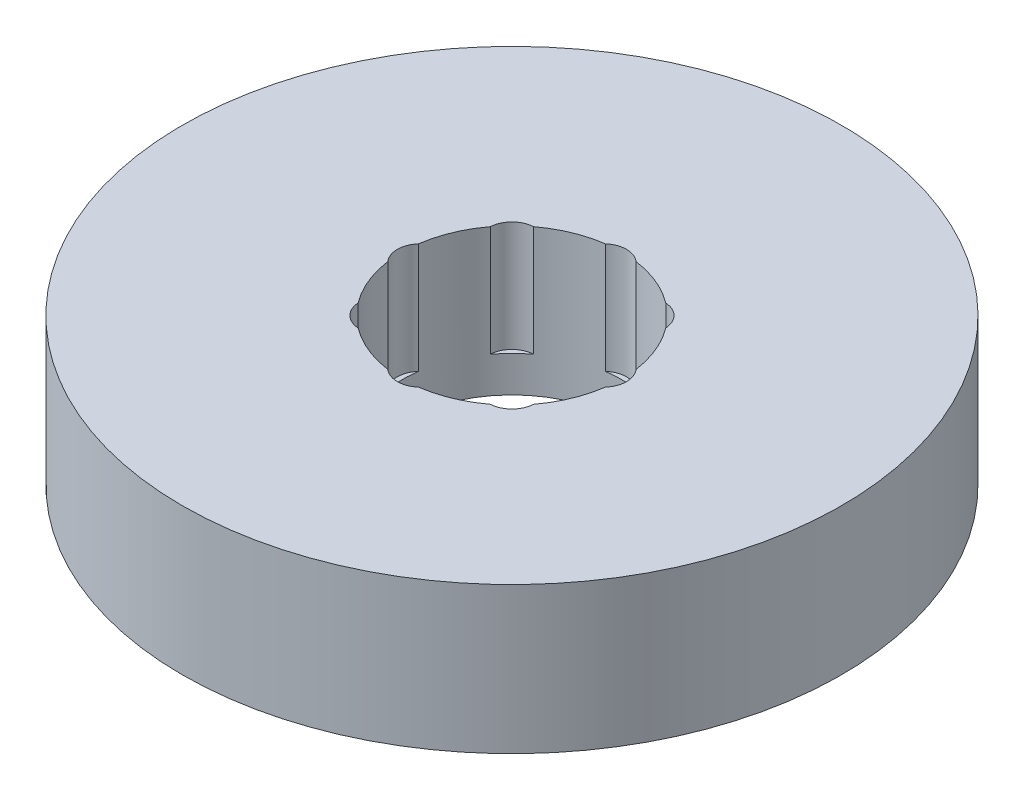
ISO-10303-21;
HEADER;
FILE_DESCRIPTION(('STEP AP214'),'2;1');
FILE_NAME('part.step','',(''),(''),'','','');
FILE_SCHEMA(('AUTOMOTIVE_DESIGN { 1 0 10303 214 1 1 1 1 }'));
ENDSEC;
DATA;
#1=APPLICATION_CONTEXT('core data for automotive mechanical design processes');
#2=APPLICATION_PROTOCOL_DEFINITION('international standard','automotive_design',2000,#1);
#3=PRODUCT_CONTEXT('',#1,'mechanical');
#4=PRODUCT('Part','Part','',(#3));
#5=PRODUCT_RELATED_PRODUCT_CATEGORY('part','',(#4));
#6=PRODUCT_DEFINITION_FORMATION('','',#4);
#7=PRODUCT_DEFINITION_CONTEXT('part definition',#1,'design');
#8=PRODUCT_DEFINITION('design','',#6,#7);
#9=PRODUCT_DEFINITION_SHAPE('','',#8);
#10=(LENGTH_UNIT() NAMED_UNIT(*) SI_UNIT(.MILLI.,.METRE.));
#11=(NAMED_UNIT(*) PLANE_ANGLE_UNIT() SI_UNIT($,.RADIAN.));
#12=(NAMED_UNIT(*) SI_UNIT($,.STERADIAN.) SOLID_ANGLE_UNIT());
#13=UNCERTAINTY_MEASURE_WITH_UNIT(LENGTH_MEASURE(1.E-05),#10,'distance_accuracy_value','');
#14=(GEOMETRIC_REPRESENTATION_CONTEXT(3) GLOBAL_UNCERTAINTY_ASSIGNED_CONTEXT((#13)) GLOBAL_UNIT_ASSIGNED_CONTEXT((#10,
#11,#12)) REPRESENTATION_CONTEXT('',''));
#15=CARTESIAN_POINT('',(0.,0.,0.));
#16=DIRECTION('',(0.,0.,1.));
#17=DIRECTION('',(1.,0.,0.));
#18=AXIS2_PLACEMENT_3D('',#15,#16,#17);
#19=CARTESIAN_POINT('',(0.,10.,0.));
#20=DIRECTION('',(0.,-1.,0.));
#21=DIRECTION('',(0.,0.,-1.));
#22=AXIS2_PLACEMENT_3D('',#19,#20,#21);
#23=CYLINDRICAL_SURFACE('',#22,22.5);
#24=CARTESIAN_POINT('',(0.,10.,0.));
#25=DIRECTION('',(0.,1.,0.));
#26=DIRECTION('',(0.,0.,1.));
#27=AXIS2_PLACEMENT_3D('',#24,#25,#26);
#28=CIRCLE('',#27,22.5);
#29=CARTESIAN_POINT('',(0.,10.,22.5));
#30=VERTEX_POINT('',#29);
#31=EDGE_CURVE('E183',#30,#30,#28,.T.);
#32=ORIENTED_EDGE('',*,*,#31,.F.);
#33=EDGE_LOOP('',(#32));
#34=FACE_BOUND('',#33,.T.);
#35=CARTESIAN_POINT('',(0.,0.,0.));
#36=DIRECTION('',(0.,1.,0.));
#37=DIRECTION('',(0.,0.,1.));
#38=AXIS2_PLACEMENT_3D('',#35,#36,#37);
#39=CIRCLE('',#38,22.5);
#40=CARTESIAN_POINT('',(0.,0.,22.5));
#41=VERTEX_POINT('',#40);
#42=EDGE_CURVE('E182',#41,#41,#39,.T.);
#43=ORIENTED_EDGE('',*,*,#42,.T.);
#44=EDGE_LOOP('',(#43));
#45=FACE_BOUND('',#44,.T.);
#46=ADVANCED_FACE('F39',(#34,#45),#23,.T.);
#47=CARTESIAN_POINT('',(0.,10.,0.));
#48=DIRECTION('',(0.,1.,0.));
#49=DIRECTION('',(0.,0.,1.));
#50=AXIS2_PLACEMENT_3D('',#47,#48,#49);
#51=PLANE('',#50);
#52=CARTESIAN_POINT('',(0.,10.,6.24532366336208));
#53=DIRECTION('',(0.,1.,0.));
#54=DIRECTION('',(1.,0.,0.));
#55=AXIS2_PLACEMENT_3D('',#52,#53,#54);
#56=CIRCLE('',#55,1.57803678648881);
#57=CARTESIAN_POINT('',(-1.04624569476172,10.,7.42666613940552));
#58=VERTEX_POINT('',#57);
#59=CARTESIAN_POINT('',(1.04624569476177,10.,7.42666613940552));
#60=VERTEX_POINT('',#59);
#61=EDGE_CURVE('E256',#58,#60,#56,.T.);
#62=ORIENTED_EDGE('',*,*,#61,.F.);
#63=CARTESIAN_POINT('',(0.,10.,0.));
#64=DIRECTION('',(0.,1.,0.));
#65=DIRECTION('',(0.,0.,1.));
#66=AXIS2_PLACEMENT_3D('',#63,#64,#65);
#67=CIRCLE('',#66,7.5);
#68=CARTESIAN_POINT('',(-4.51163856322889,10.,5.99125341433543));
#69=VERTEX_POINT('',#68);
#70=EDGE_CURVE('E175',#69,#58,#67,.T.);
#71=ORIENTED_EDGE('',*,*,#70,.F.);
#72=CARTESIAN_POINT('',(-4.41611071306813,10.,4.41611071306815));
#73=DIRECTION('',(0.,1.,0.));
#74=DIRECTION('',(0.707106781186549,0.,0.707106781186546));
#75=AXIS2_PLACEMENT_3D('',#72,#73,#74);
#76=CIRCLE('',#75,1.57803678648881);
#77=CARTESIAN_POINT('',(-5.99125341433541,10.,4.51163856322891));
#78=VERTEX_POINT('',#77);
#79=EDGE_CURVE('E152',#78,#69,#76,.T.);
#80=ORIENTED_EDGE('',*,*,#79,.F.);
#81=CARTESIAN_POINT('',(-7.42666613940552,10.,1.04624569476175));
#82=VERTEX_POINT('',#81);
#83=EDGE_CURVE('E168',#82,#78,#67,.T.);
#84=ORIENTED_EDGE('',*,*,#83,.F.);
#85=CARTESIAN_POINT('',(-6.24532366336208,10.,0.));
#86=DIRECTION('',(0.,1.,0.));
#87=DIRECTION('',(0.,0.,1.));
#88=AXIS2_PLACEMENT_3D('',#85,#86,#87);
#89=CIRCLE('',#88,1.57803678648881);
#90=CARTESIAN_POINT('',(-7.42666613940552,10.,-1.04624569476175));
#91=VERTEX_POINT('',#90);
#92=EDGE_CURVE('E205',#91,#82,#89,.T.);
#93=ORIENTED_EDGE('',*,*,#92,.F.);
#94=CARTESIAN_POINT('',(-5.99125341433548,10.,-4.51163856322883));
#95=VERTEX_POINT('',#94);
#96=EDGE_CURVE('E181',#95,#91,#67,.T.);
#97=ORIENTED_EDGE('',*,*,#96,.F.);
#98=CARTESIAN_POINT('',(-4.41611071306819,10.,-4.41611071306809));
#99=DIRECTION('',(0.,1.,0.));
#100=DIRECTION('',(-0.707106781186539,0.,0.707106781186556));
#101=AXIS2_PLACEMENT_3D('',#98,#99,#100);
#102=CIRCLE('',#101,1.57803678648881);
#103=CARTESIAN_POINT('',(-4.51163856322897,10.,-5.99125341433537));
#104=VERTEX_POINT('',#103);
#105=EDGE_CURVE('E453',#104,#95,#102,.T.);
#106=ORIENTED_EDGE('',*,*,#105,.F.);
#107=CARTESIAN_POINT('',(-1.04624569476182,10.,-7.42666613940551));
#108=VERTEX_POINT('',#107);
#109=EDGE_CURVE('E189',#108,#104,#67,.T.);
#110=ORIENTED_EDGE('',*,*,#109,.F.);
#111=CARTESIAN_POINT('',(0.,10.,-6.24532366336208));
#112=DIRECTION('',(0.,1.,0.));
#113=DIRECTION('',(-1.,0.,0.));
#114=AXIS2_PLACEMENT_3D('',#111,#112,#113);
#115=CIRCLE('',#114,1.57803678648881);
#116=CARTESIAN_POINT('',(1.04624569476167,10.,-7.42666613940553));
#117=VERTEX_POINT('',#116);
#118=EDGE_CURVE('E462',#117,#108,#115,.T.);
#119=ORIENTED_EDGE('',*,*,#118,.F.);
#120=CARTESIAN_POINT('',(4.51163856322885,10.,-5.99125341433546));
#121=VERTEX_POINT('',#120);
#122=EDGE_CURVE('E197',#121,#117,#67,.T.);
#123=ORIENTED_EDGE('',*,*,#122,.F.);
#124=CARTESIAN_POINT('',(4.4161107130681,10.,-4.41611071306818));
#125=DIRECTION('',(0.,1.,0.));
#126=DIRECTION('',(-0.707106781186554,0.,-0.707106781186541));
#127=AXIS2_PLACEMENT_3D('',#124,#125,#126);
#128=CIRCLE('',#127,1.57803678648881);
#129=CARTESIAN_POINT('',(5.99125341433538,10.,-4.51163856322895));
#130=VERTEX_POINT('',#129);
#131=EDGE_CURVE('E470',#130,#121,#128,.T.);
#132=ORIENTED_EDGE('',*,*,#131,.F.);
#133=CARTESIAN_POINT('',(7.42666613940552,10.,-1.04624569476175));
#134=VERTEX_POINT('',#133);
#135=EDGE_CURVE('E489',#134,#130,#67,.T.);
#136=ORIENTED_EDGE('',*,*,#135,.F.);
#137=CARTESIAN_POINT('',(6.24532366336208,10.,0.));
#138=DIRECTION('',(0.,1.,0.));
#139=DIRECTION('',(0.,0.,-1.));
#140=AXIS2_PLACEMENT_3D('',#137,#138,#139);
#141=CIRCLE('',#140,1.57803678648881);
#142=CARTESIAN_POINT('',(7.42666613940552,10.,1.04624569476175));
#143=VERTEX_POINT('',#142);
#144=EDGE_CURVE('E476',#143,#134,#141,.T.);
#145=ORIENTED_EDGE('',*,*,#144,.F.);
#146=CARTESIAN_POINT('',(5.99125341433545,10.,4.51163856322887));
#147=VERTEX_POINT('',#146);
#148=EDGE_CURVE('E491',#147,#143,#67,.T.);
#149=ORIENTED_EDGE('',*,*,#148,.F.);
#150=CARTESIAN_POINT('',(4.41611071306816,10.,4.41611071306812));
#151=DIRECTION('',(0.,1.,0.));
#152=DIRECTION('',(0.707106781186544,0.,-0.707106781186551));
#153=AXIS2_PLACEMENT_3D('',#150,#151,#152);
#154=CIRCLE('',#153,1.57803678648881);
#155=CARTESIAN_POINT('',(4.51163856322893,10.,5.9912534143354));
#156=VERTEX_POINT('',#155);
#157=EDGE_CURVE('E475',#156,#147,#154,.T.);
#158=ORIENTED_EDGE('',*,*,#157,.F.);
#159=EDGE_CURVE('E190',#60,#156,#67,.T.);
#160=ORIENTED_EDGE('',*,*,#159,.F.);
#161=EDGE_LOOP('',(#62,#71,#80,#84,#93,#97,#106,#110,#119,#123,#132,#136,#145,#149,#158,#160));
#162=FACE_BOUND('',#161,.T.);
#163=ORIENTED_EDGE('',*,*,#31,.T.);
#164=EDGE_LOOP('',(#163));
#165=FACE_BOUND('',#164,.T.);
#166=ADVANCED_FACE('F170',(#162,#165),#51,.T.);
#167=CARTESIAN_POINT('',(0.,0.,0.));
#168=DIRECTION('',(0.,1.,0.));
#169=DIRECTION('',(0.,0.,1.));
#170=AXIS2_PLACEMENT_3D('',#167,#168,#169);
#171=PLANE('',#170);
#172=CARTESIAN_POINT('',(0.,0.,0.));
#173=DIRECTION('',(0.,1.,0.));
#174=DIRECTION('',(0.,0.,1.));
#175=AXIS2_PLACEMENT_3D('',#172,#173,#174);
#176=CIRCLE('',#175,7.5);
#177=CARTESIAN_POINT('',(0.,0.,7.5));
#178=VERTEX_POINT('',#177);
#179=EDGE_CURVE('E191',#178,#178,#176,.T.);
#180=ORIENTED_EDGE('',*,*,#179,.T.);
#181=EDGE_LOOP('',(#180));
#182=FACE_BOUND('',#181,.T.);
#183=ORIENTED_EDGE('',*,*,#42,.F.);
#184=EDGE_LOOP('',(#183));
#185=FACE_BOUND('',#184,.T.);
#186=ADVANCED_FACE('F277',(#182,#185),#171,.F.);
#187=CARTESIAN_POINT('',(0.,10.,0.));
#188=DIRECTION('',(0.,-1.,0.));
#189=DIRECTION('',(0.,0.,-1.));
#190=AXIS2_PLACEMENT_3D('',#187,#188,#189);
#191=CYLINDRICAL_SURFACE('',#190,7.5);
#192=DIRECTION('',(0.,1.,0.));
#193=VECTOR('',#192,1.);
#194=CARTESIAN_POINT('',(-1.04624569476172,6.22964103238168,7.42666613940552));
#195=LINE('',#194,#193);
#196=CARTESIAN_POINT('',(-1.04624569476172,2.45928206476335,7.42666613940552));
#197=VERTEX_POINT('',#196);
#198=EDGE_CURVE('E11',#197,#58,#195,.T.);
#199=ORIENTED_EDGE('',*,*,#198,.F.);
#200=CARTESIAN_POINT('',(0.,2.45928206476335,0.));
#201=DIRECTION('',(0.,1.,0.));
#202=DIRECTION('',(0.,0.,1.));
#203=AXIS2_PLACEMENT_3D('',#200,#201,#202);
#204=CIRCLE('',#203,7.5);
#205=CARTESIAN_POINT('',(1.04624569476177,2.45928206476335,7.42666613940552));
#206=VERTEX_POINT('',#205);
#207=EDGE_CURVE('E251',#197,#206,#204,.T.);
#208=ORIENTED_EDGE('',*,*,#207,.T.);
#209=DIRECTION('',(0.,1.,0.));
#210=VECTOR('',#209,1.);
#211=CARTESIAN_POINT('',(1.04624569476177,6.22964103238168,7.42666613940551));
#212=LINE('',#211,#210);
#213=EDGE_CURVE('E46',#60,#206,#212,.F.);
#214=ORIENTED_EDGE('',*,*,#213,.F.);
#215=ORIENTED_EDGE('',*,*,#159,.T.);
#216=DIRECTION('',(0.,1.,0.));
#217=VECTOR('',#216,1.);
#218=CARTESIAN_POINT('',(4.51163856322893,6.22964103238168,5.9912534143354));
#219=LINE('',#218,#217);
#220=CARTESIAN_POINT('',(4.51163856322893,2.45928206476335,5.9912534143354));
#221=VERTEX_POINT('',#220);
#222=EDGE_CURVE('E253',#221,#156,#219,.T.);
#223=ORIENTED_EDGE('',*,*,#222,.F.);
#224=CARTESIAN_POINT('',(0.,2.45928206476335,0.));
#225=DIRECTION('',(0.,1.,0.));
#226=DIRECTION('',(0.,0.,1.));
#227=AXIS2_PLACEMENT_3D('',#224,#225,#226);
#228=CIRCLE('',#227,7.5);
#229=CARTESIAN_POINT('',(5.99125341433545,2.45928206476335,4.51163856322887));
#230=VERTEX_POINT('',#229);
#231=EDGE_CURVE('E246',#221,#230,#228,.T.);
#232=ORIENTED_EDGE('',*,*,#231,.T.);
#233=DIRECTION('',(0.,1.,0.));
#234=VECTOR('',#233,1.);
#235=CARTESIAN_POINT('',(5.99125341433545,6.22964103238168,4.51163856322886));
#236=LINE('',#235,#234);
#237=EDGE_CURVE('E248',#147,#230,#236,.F.);
#238=ORIENTED_EDGE('',*,*,#237,.F.);
#239=ORIENTED_EDGE('',*,*,#148,.T.);
#240=DIRECTION('',(0.,1.,0.));
#241=VECTOR('',#240,1.);
#242=CARTESIAN_POINT('',(7.42666613940552,6.22964103238168,1.04624569476175));
#243=LINE('',#242,#241);
#244=CARTESIAN_POINT('',(7.42666613940552,2.45928206476335,1.04624569476175));
#245=VERTEX_POINT('',#244);
#246=EDGE_CURVE('E243',#245,#143,#243,.T.);
#247=ORIENTED_EDGE('',*,*,#246,.F.);
#248=CARTESIAN_POINT('',(0.,2.45928206476335,0.));
#249=DIRECTION('',(0.,1.,0.));
#250=DIRECTION('',(0.,0.,1.));
#251=AXIS2_PLACEMENT_3D('',#248,#249,#250);
#252=CIRCLE('',#251,7.5);
#253=CARTESIAN_POINT('',(7.42666613940552,2.45928206476335,-1.04624569476175));
#254=VERTEX_POINT('',#253);
#255=EDGE_CURVE('E236',#245,#254,#252,.T.);
#256=ORIENTED_EDGE('',*,*,#255,.T.);
#257=DIRECTION('',(0.,1.,0.));
#258=VECTOR('',#257,1.);
#259=CARTESIAN_POINT('',(7.42666613940552,6.22964103238168,-1.04624569476175));
#260=LINE('',#259,#258);
#261=EDGE_CURVE('E241',#134,#254,#260,.F.);
#262=ORIENTED_EDGE('',*,*,#261,.F.);
#263=ORIENTED_EDGE('',*,*,#135,.T.);
#264=DIRECTION('',(0.,1.,0.));
#265=VECTOR('',#264,1.);
#266=CARTESIAN_POINT('',(5.99125341433538,6.22964103238168,-4.51163856322895));
#267=LINE('',#266,#265);
#268=CARTESIAN_POINT('',(5.99125341433538,2.45928206476335,-4.51163856322895));
#269=VERTEX_POINT('',#268);
#270=EDGE_CURVE('E237',#269,#130,#267,.T.);
#271=ORIENTED_EDGE('',*,*,#270,.F.);
#272=CARTESIAN_POINT('',(0.,2.45928206476335,0.));
#273=DIRECTION('',(0.,1.,0.));
#274=DIRECTION('',(0.,0.,1.));
#275=AXIS2_PLACEMENT_3D('',#272,#273,#274);
#276=CIRCLE('',#275,7.5);
#277=CARTESIAN_POINT('',(4.51163856322885,2.45928206476335,-5.99125341433546));
#278=VERTEX_POINT('',#277);
#279=EDGE_CURVE('E229',#269,#278,#276,.T.);
#280=ORIENTED_EDGE('',*,*,#279,.T.);
#281=DIRECTION('',(0.,1.,0.));
#282=VECTOR('',#281,1.);
#283=CARTESIAN_POINT('',(4.51163856322884,6.22964103238168,-5.99125341433546));
#284=LINE('',#283,#282);
#285=EDGE_CURVE('E232',#121,#278,#284,.F.);
#286=ORIENTED_EDGE('',*,*,#285,.F.);
#287=ORIENTED_EDGE('',*,*,#122,.T.);
#288=DIRECTION('',(0.,1.,0.));
#289=VECTOR('',#288,1.);
#290=CARTESIAN_POINT('',(1.04624569476167,6.22964103238168,-7.42666613940553));
#291=LINE('',#290,#289);
#292=CARTESIAN_POINT('',(1.04624569476167,2.45928206476335,-7.42666613940553));
#293=VERTEX_POINT('',#292);
#294=EDGE_CURVE('E227',#293,#117,#291,.T.);
#295=ORIENTED_EDGE('',*,*,#294,.F.);
#296=CARTESIAN_POINT('',(0.,2.45928206476335,0.));
#297=DIRECTION('',(0.,1.,0.));
#298=DIRECTION('',(0.,0.,1.));
#299=AXIS2_PLACEMENT_3D('',#296,#297,#298);
#300=CIRCLE('',#299,7.5);
#301=CARTESIAN_POINT('',(-1.04624569476182,2.45928206476335,-7.42666613940551));
#302=VERTEX_POINT('',#301);
#303=EDGE_CURVE('E225',#293,#302,#300,.T.);
#304=ORIENTED_EDGE('',*,*,#303,.T.);
#305=DIRECTION('',(0.,1.,0.));
#306=VECTOR('',#305,1.);
#307=CARTESIAN_POINT('',(-1.04624569476183,6.22964103238168,-7.42666613940551));
#308=LINE('',#307,#306);
#309=EDGE_CURVE('E223',#108,#302,#308,.F.);
#310=ORIENTED_EDGE('',*,*,#309,.F.);
#311=ORIENTED_EDGE('',*,*,#109,.T.);
#312=DIRECTION('',(0.,1.,0.));
#313=VECTOR('',#312,1.);
#314=CARTESIAN_POINT('',(-4.51163856322897,6.22964103238168,-5.99125341433537));
#315=LINE('',#314,#313);
#316=CARTESIAN_POINT('',(-4.51163856322897,2.45928206476335,-5.99125341433537));
#317=VERTEX_POINT('',#316);
#318=EDGE_CURVE('E219',#317,#104,#315,.T.);
#319=ORIENTED_EDGE('',*,*,#318,.F.);
#320=CARTESIAN_POINT('',(0.,2.45928206476335,0.));
#321=DIRECTION('',(0.,1.,0.));
#322=DIRECTION('',(0.,0.,1.));
#323=AXIS2_PLACEMENT_3D('',#320,#321,#322);
#324=CIRCLE('',#323,7.5);
#325=CARTESIAN_POINT('',(-5.99125341433548,2.45928206476335,-4.51163856322883));
#326=VERTEX_POINT('',#325);
#327=EDGE_CURVE('E159',#317,#326,#324,.T.);
#328=ORIENTED_EDGE('',*,*,#327,.T.);
#329=DIRECTION('',(0.,1.,0.));
#330=VECTOR('',#329,1.);
#331=CARTESIAN_POINT('',(-5.99125341433548,6.22964103238168,-4.51163856322882));
#332=LINE('',#331,#330);
#333=EDGE_CURVE('E220',#95,#326,#332,.F.);
#334=ORIENTED_EDGE('',*,*,#333,.F.);
#335=ORIENTED_EDGE('',*,*,#96,.T.);
#336=DIRECTION('',(0.,1.,0.));
#337=VECTOR('',#336,1.);
#338=CARTESIAN_POINT('',(-7.42666613940552,6.22964103238168,-1.04624569476175));
#339=LINE('',#338,#337);
#340=CARTESIAN_POINT('',(-7.42666613940552,2.45928206476335,-1.04624569476175));
#341=VERTEX_POINT('',#340);
#342=EDGE_CURVE('E209',#341,#91,#339,.T.);
#343=ORIENTED_EDGE('',*,*,#342,.F.);
#344=CARTESIAN_POINT('',(0.,2.45928206476335,0.));
#345=DIRECTION('',(0.,1.,0.));
#346=DIRECTION('',(0.,0.,1.));
#347=AXIS2_PLACEMENT_3D('',#344,#345,#346);
#348=CIRCLE('',#347,7.5);
#349=CARTESIAN_POINT('',(-7.42666613940552,2.45928206476335,1.04624569476175));
#350=VERTEX_POINT('',#349);
#351=EDGE_CURVE('E206',#341,#350,#348,.T.);
#352=ORIENTED_EDGE('',*,*,#351,.T.);
#353=DIRECTION('',(0.,1.,0.));
#354=VECTOR('',#353,1.);
#355=CARTESIAN_POINT('',(-7.42666613940552,6.22964103238168,1.04624569476175));
#356=LINE('',#355,#354);
#357=EDGE_CURVE('E179',#82,#350,#356,.F.);
#358=ORIENTED_EDGE('',*,*,#357,.F.);
#359=ORIENTED_EDGE('',*,*,#83,.T.);
#360=DIRECTION('',(0.,1.,0.));
#361=VECTOR('',#360,1.);
#362=CARTESIAN_POINT('',(-5.99125341433542,6.22964103238168,4.51163856322891));
#363=LINE('',#362,#361);
#364=CARTESIAN_POINT('',(-5.99125341433541,2.45928206476335,4.51163856322891));
#365=VERTEX_POINT('',#364);
#366=EDGE_CURVE('E147',#365,#78,#363,.T.);
#367=ORIENTED_EDGE('',*,*,#366,.F.);
#368=CARTESIAN_POINT('',(0.,2.45928206476335,0.));
#369=DIRECTION('',(0.,1.,0.));
#370=DIRECTION('',(0.,0.,1.));
#371=AXIS2_PLACEMENT_3D('',#368,#369,#370);
#372=CIRCLE('',#371,7.5);
#373=CARTESIAN_POINT('',(-4.51163856322889,2.45928206476335,5.99125341433543));
#374=VERTEX_POINT('',#373);
#375=EDGE_CURVE('E215',#365,#374,#372,.T.);
#376=ORIENTED_EDGE('',*,*,#375,.T.);
#377=DIRECTION('',(0.,1.,0.));
#378=VECTOR('',#377,1.);
#379=CARTESIAN_POINT('',(-4.51163856322889,6.22964103238168,5.99125341433543));
#380=LINE('',#379,#378);
#381=EDGE_CURVE('E161',#69,#374,#380,.F.);
#382=ORIENTED_EDGE('',*,*,#381,.F.);
#383=ORIENTED_EDGE('',*,*,#70,.T.);
#384=EDGE_LOOP('',(#199,#208,#214,#215,#223,#232,#238,#239,#247,#256,#262,#263,#271,#280,#286,
#287,#295,#304,#310,#311,#319,#328,#334,#335,#343,#352,#358,#359,#367,#376,#382,#383));
#385=FACE_BOUND('',#384,.T.);
#386=ORIENTED_EDGE('',*,*,#179,.F.);
#387=EDGE_LOOP('',(#386));
#388=FACE_BOUND('',#387,.T.);
#389=ADVANCED_FACE('F176',(#385,#388),#191,.F.);
#390=CARTESIAN_POINT('',(-6.24532366336208,2.45928206476335,0.));
#391=DIRECTION('',(0.,1.,0.));
#392=DIRECTION('',(0.,0.,1.));
#393=AXIS2_PLACEMENT_3D('',#390,#391,#392);
#394=CYLINDRICAL_SURFACE('',#393,1.57803678648881);
#395=ORIENTED_EDGE('',*,*,#342,.T.);
#396=ORIENTED_EDGE('',*,*,#92,.T.);
#397=ORIENTED_EDGE('',*,*,#357,.T.);
#398=CARTESIAN_POINT('',(-6.24532366336208,2.45928206476335,0.));
#399=DIRECTION('',(0.,1.,0.));
#400=DIRECTION('',(0.,0.,1.));
#401=AXIS2_PLACEMENT_3D('',#398,#399,#400);
#402=CIRCLE('',#401,1.57803678648881);
#403=EDGE_CURVE('E200',#341,#350,#402,.T.);
#404=ORIENTED_EDGE('',*,*,#403,.F.);
#405=EDGE_LOOP('',(#395,#396,#397,#404));
#406=FACE_BOUND('',#405,.T.);
#407=ADVANCED_FACE('F286',(#406),#394,.F.);
#408=CARTESIAN_POINT('',(-6.24532366336208,2.45928206476335,0.));
#409=DIRECTION('',(0.,1.,0.));
#410=DIRECTION('',(0.,0.,1.));
#411=AXIS2_PLACEMENT_3D('',#408,#409,#410);
#412=PLANE('',#411);
#413=ORIENTED_EDGE('',*,*,#403,.T.);
#414=ORIENTED_EDGE('',*,*,#351,.F.);
#415=EDGE_LOOP('',(#413,#414));
#416=FACE_BOUND('',#415,.T.);
#417=ADVANCED_FACE('F289',(#416),#412,.T.);
#418=CARTESIAN_POINT('',(-4.41611071306813,2.45928206476335,4.41611071306815));
#419=DIRECTION('',(0.,1.,0.));
#420=DIRECTION('',(0.,0.,1.));
#421=AXIS2_PLACEMENT_3D('',#418,#419,#420);
#422=CYLINDRICAL_SURFACE('',#421,1.57803678648881);
#423=ORIENTED_EDGE('',*,*,#366,.T.);
#424=ORIENTED_EDGE('',*,*,#79,.T.);
#425=ORIENTED_EDGE('',*,*,#381,.T.);
#426=CARTESIAN_POINT('',(-4.41611071306813,2.45928206476335,4.41611071306815));
#427=DIRECTION('',(0.,1.,0.));
#428=DIRECTION('',(0.707106781186549,0.,0.707106781186546));
#429=AXIS2_PLACEMENT_3D('',#426,#427,#428);
#430=CIRCLE('',#429,1.57803678648881);
#431=EDGE_CURVE('E156',#365,#374,#430,.T.);
#432=ORIENTED_EDGE('',*,*,#431,.F.);
#433=EDGE_LOOP('',(#423,#424,#425,#432));
#434=FACE_BOUND('',#433,.T.);
#435=ADVANCED_FACE('F155',(#434),#422,.F.);
#436=CARTESIAN_POINT('',(-4.41611071306813,2.45928206476335,4.41611071306815));
#437=DIRECTION('',(0.,1.,0.));
#438=DIRECTION('',(0.707106781186549,0.,0.707106781186546));
#439=AXIS2_PLACEMENT_3D('',#436,#437,#438);
#440=PLANE('',#439);
#441=ORIENTED_EDGE('',*,*,#431,.T.);
#442=ORIENTED_EDGE('',*,*,#375,.F.);
#443=EDGE_LOOP('',(#441,#442));
#444=FACE_BOUND('',#443,.T.);
#445=ADVANCED_FACE('F300',(#444),#440,.T.);
#446=CARTESIAN_POINT('',(-4.41611071306819,2.45928206476335,-4.41611071306809));
#447=DIRECTION('',(0.,1.,0.));
#448=DIRECTION('',(0.,0.,1.));
#449=AXIS2_PLACEMENT_3D('',#446,#447,#448);
#450=CYLINDRICAL_SURFACE('',#449,1.57803678648881);
#451=ORIENTED_EDGE('',*,*,#318,.T.);
#452=ORIENTED_EDGE('',*,*,#105,.T.);
#453=ORIENTED_EDGE('',*,*,#333,.T.);
#454=CARTESIAN_POINT('',(-4.41611071306819,2.45928206476335,-4.41611071306809));
#455=DIRECTION('',(0.,1.,0.));
#456=DIRECTION('',(-0.707106781186539,0.,0.707106781186556));
#457=AXIS2_PLACEMENT_3D('',#454,#455,#456);
#458=CIRCLE('',#457,1.57803678648881);
#459=EDGE_CURVE('E454',#317,#326,#458,.T.);
#460=ORIENTED_EDGE('',*,*,#459,.F.);
#461=EDGE_LOOP('',(#451,#452,#453,#460));
#462=FACE_BOUND('',#461,.T.);
#463=ADVANCED_FACE('F299',(#462),#450,.F.);
#464=CARTESIAN_POINT('',(-4.41611071306819,2.45928206476335,-4.41611071306809));
#465=DIRECTION('',(0.,1.,0.));
#466=DIRECTION('',(-0.707106781186539,0.,0.707106781186556));
#467=AXIS2_PLACEMENT_3D('',#464,#465,#466);
#468=PLANE('',#467);
#469=ORIENTED_EDGE('',*,*,#459,.T.);
#470=ORIENTED_EDGE('',*,*,#327,.F.);
#471=EDGE_LOOP('',(#469,#470));
#472=FACE_BOUND('',#471,.T.);
#473=ADVANCED_FACE('F379',(#472),#468,.T.);
#474=CARTESIAN_POINT('',(0.,2.45928206476335,-6.24532366336208));
#475=DIRECTION('',(0.,1.,0.));
#476=DIRECTION('',(0.,0.,1.));
#477=AXIS2_PLACEMENT_3D('',#474,#475,#476);
#478=CYLINDRICAL_SURFACE('',#477,1.57803678648881);
#479=ORIENTED_EDGE('',*,*,#294,.T.);
#480=ORIENTED_EDGE('',*,*,#118,.T.);
#481=ORIENTED_EDGE('',*,*,#309,.T.);
#482=CARTESIAN_POINT('',(0.,2.45928206476335,-6.24532366336208));
#483=DIRECTION('',(0.,1.,0.));
#484=DIRECTION('',(-1.,0.,0.));
#485=AXIS2_PLACEMENT_3D('',#482,#483,#484);
#486=CIRCLE('',#485,1.57803678648881);
#487=EDGE_CURVE('E465',#293,#302,#486,.T.);
#488=ORIENTED_EDGE('',*,*,#487,.F.);
#489=EDGE_LOOP('',(#479,#480,#481,#488));
#490=FACE_BOUND('',#489,.T.);
#491=ADVANCED_FACE('F371',(#490),#478,.F.);
#492=CARTESIAN_POINT('',(0.,2.45928206476335,-6.24532366336208));
#493=DIRECTION('',(0.,1.,0.));
#494=DIRECTION('',(-1.,0.,0.));
#495=AXIS2_PLACEMENT_3D('',#492,#493,#494);
#496=PLANE('',#495);
#497=ORIENTED_EDGE('',*,*,#487,.T.);
#498=ORIENTED_EDGE('',*,*,#303,.F.);
#499=EDGE_LOOP('',(#497,#498));
#500=FACE_BOUND('',#499,.T.);
#501=ADVANCED_FACE('F308',(#500),#496,.T.);
#502=CARTESIAN_POINT('',(4.4161107130681,2.45928206476335,-4.41611071306818));
#503=DIRECTION('',(0.,1.,0.));
#504=DIRECTION('',(0.,0.,1.));
#505=AXIS2_PLACEMENT_3D('',#502,#503,#504);
#506=CYLINDRICAL_SURFACE('',#505,1.57803678648881);
#507=ORIENTED_EDGE('',*,*,#270,.T.);
#508=ORIENTED_EDGE('',*,*,#131,.T.);
#509=ORIENTED_EDGE('',*,*,#285,.T.);
#510=CARTESIAN_POINT('',(4.4161107130681,2.45928206476335,-4.41611071306818));
#511=DIRECTION('',(0.,1.,0.));
#512=DIRECTION('',(-0.707106781186554,0.,-0.707106781186541));
#513=AXIS2_PLACEMENT_3D('',#510,#511,#512);
#514=CIRCLE('',#513,1.57803678648881);
#515=EDGE_CURVE('E477',#269,#278,#514,.T.);
#516=ORIENTED_EDGE('',*,*,#515,.F.);
#517=EDGE_LOOP('',(#507,#508,#509,#516));
#518=FACE_BOUND('',#517,.T.);
#519=ADVANCED_FACE('F305',(#518),#506,.F.);
#520=CARTESIAN_POINT('',(4.4161107130681,2.45928206476335,-4.41611071306818));
#521=DIRECTION('',(0.,1.,0.));
#522=DIRECTION('',(-0.707106781186554,0.,-0.707106781186541));
#523=AXIS2_PLACEMENT_3D('',#520,#521,#522);
#524=PLANE('',#523);
#525=ORIENTED_EDGE('',*,*,#515,.T.);
#526=ORIENTED_EDGE('',*,*,#279,.F.);
#527=EDGE_LOOP('',(#525,#526));
#528=FACE_BOUND('',#527,.T.);
#529=ADVANCED_FACE('F304',(#528),#524,.T.);
#530=CARTESIAN_POINT('',(6.24532366336208,2.45928206476335,0.));
#531=DIRECTION('',(0.,1.,0.));
#532=DIRECTION('',(0.,0.,1.));
#533=AXIS2_PLACEMENT_3D('',#530,#531,#532);
#534=CYLINDRICAL_SURFACE('',#533,1.57803678648881);
#535=ORIENTED_EDGE('',*,*,#246,.T.);
#536=ORIENTED_EDGE('',*,*,#144,.T.);
#537=ORIENTED_EDGE('',*,*,#261,.T.);
#538=CARTESIAN_POINT('',(6.24532366336208,2.45928206476335,0.));
#539=DIRECTION('',(0.,1.,0.));
#540=DIRECTION('',(0.,0.,-1.));
#541=AXIS2_PLACEMENT_3D('',#538,#539,#540);
#542=CIRCLE('',#541,1.57803678648881);
#543=EDGE_CURVE('E478',#245,#254,#542,.T.);
#544=ORIENTED_EDGE('',*,*,#543,.F.);
#545=EDGE_LOOP('',(#535,#536,#537,#544));
#546=FACE_BOUND('',#545,.T.);
#547=ADVANCED_FACE('F309',(#546),#534,.F.);
#548=CARTESIAN_POINT('',(6.24532366336208,2.45928206476335,0.));
#549=DIRECTION('',(0.,1.,0.));
#550=DIRECTION('',(0.,0.,-1.));
#551=AXIS2_PLACEMENT_3D('',#548,#549,#550);
#552=PLANE('',#551);
#553=ORIENTED_EDGE('',*,*,#543,.T.);
#554=ORIENTED_EDGE('',*,*,#255,.F.);
#555=EDGE_LOOP('',(#553,#554));
#556=FACE_BOUND('',#555,.T.);
#557=ADVANCED_FACE('F314',(#556),#552,.T.);
#558=CARTESIAN_POINT('',(4.41611071306816,2.45928206476335,4.41611071306812));
#559=DIRECTION('',(0.,1.,0.));
#560=DIRECTION('',(0.,0.,1.));
#561=AXIS2_PLACEMENT_3D('',#558,#559,#560);
#562=CYLINDRICAL_SURFACE('',#561,1.57803678648881);
#563=ORIENTED_EDGE('',*,*,#222,.T.);
#564=ORIENTED_EDGE('',*,*,#157,.T.);
#565=ORIENTED_EDGE('',*,*,#237,.T.);
#566=CARTESIAN_POINT('',(4.41611071306816,2.45928206476335,4.41611071306812));
#567=DIRECTION('',(0.,1.,0.));
#568=DIRECTION('',(0.707106781186544,0.,-0.707106781186551));
#569=AXIS2_PLACEMENT_3D('',#566,#567,#568);
#570=CIRCLE('',#569,1.57803678648881);
#571=EDGE_CURVE('E56',#221,#230,#570,.T.);
#572=ORIENTED_EDGE('',*,*,#571,.F.);
#573=EDGE_LOOP('',(#563,#564,#565,#572));
#574=FACE_BOUND('',#573,.T.);
#575=ADVANCED_FACE('F318',(#574),#562,.F.);
#576=CARTESIAN_POINT('',(4.41611071306816,2.45928206476335,4.41611071306812));
#577=DIRECTION('',(0.,1.,0.));
#578=DIRECTION('',(0.707106781186544,0.,-0.707106781186551));
#579=AXIS2_PLACEMENT_3D('',#576,#577,#578);
#580=PLANE('',#579);
#581=ORIENTED_EDGE('',*,*,#571,.T.);
#582=ORIENTED_EDGE('',*,*,#231,.F.);
#583=EDGE_LOOP('',(#581,#582));
#584=FACE_BOUND('',#583,.T.);
#585=ADVANCED_FACE('F270',(#584),#580,.T.);
#586=CARTESIAN_POINT('',(0.,2.45928206476335,6.24532366336208));
#587=DIRECTION('',(0.,1.,0.));
#588=DIRECTION('',(0.,0.,1.));
#589=AXIS2_PLACEMENT_3D('',#586,#587,#588);
#590=CYLINDRICAL_SURFACE('',#589,1.57803678648881);
#591=ORIENTED_EDGE('',*,*,#198,.T.);
#592=ORIENTED_EDGE('',*,*,#61,.T.);
#593=ORIENTED_EDGE('',*,*,#213,.T.);
#594=CARTESIAN_POINT('',(0.,2.45928206476335,6.24532366336208));
#595=DIRECTION('',(0.,1.,0.));
#596=DIRECTION('',(1.,0.,0.));
#597=AXIS2_PLACEMENT_3D('',#594,#595,#596);
#598=CIRCLE('',#597,1.57803678648881);
#599=EDGE_CURVE('E55',#197,#206,#598,.T.);
#600=ORIENTED_EDGE('',*,*,#599,.F.);
#601=EDGE_LOOP('',(#591,#592,#593,#600));
#602=FACE_BOUND('',#601,.T.);
#603=ADVANCED_FACE('F260',(#602),#590,.F.);
#604=CARTESIAN_POINT('',(0.,2.45928206476335,6.24532366336208));
#605=DIRECTION('',(0.,1.,0.));
#606=DIRECTION('',(1.,0.,0.));
#607=AXIS2_PLACEMENT_3D('',#604,#605,#606);
#608=PLANE('',#607);
#609=ORIENTED_EDGE('',*,*,#599,.T.);
#610=ORIENTED_EDGE('',*,*,#207,.F.);
#611=EDGE_LOOP('',(#609,#610));
#612=FACE_BOUND('',#611,.T.);
#613=ADVANCED_FACE('F261',(#612),#608,.T.);
#614=CLOSED_SHELL('',(#46,#166,#186,#389,#407,#417,#435,#445,#463,#473,#491,#501,#519,#529,#547,
#557,#575,#585,#603,#613));
#615=MANIFOLD_SOLID_BREP('B2',#614);
#616=ADVANCED_BREP_SHAPE_REPRESENTATION('',(#18,#615),#14);
#617=SHAPE_DEFINITION_REPRESENTATION(#9,#616);
ENDSEC;
END-ISO-10303-21;
